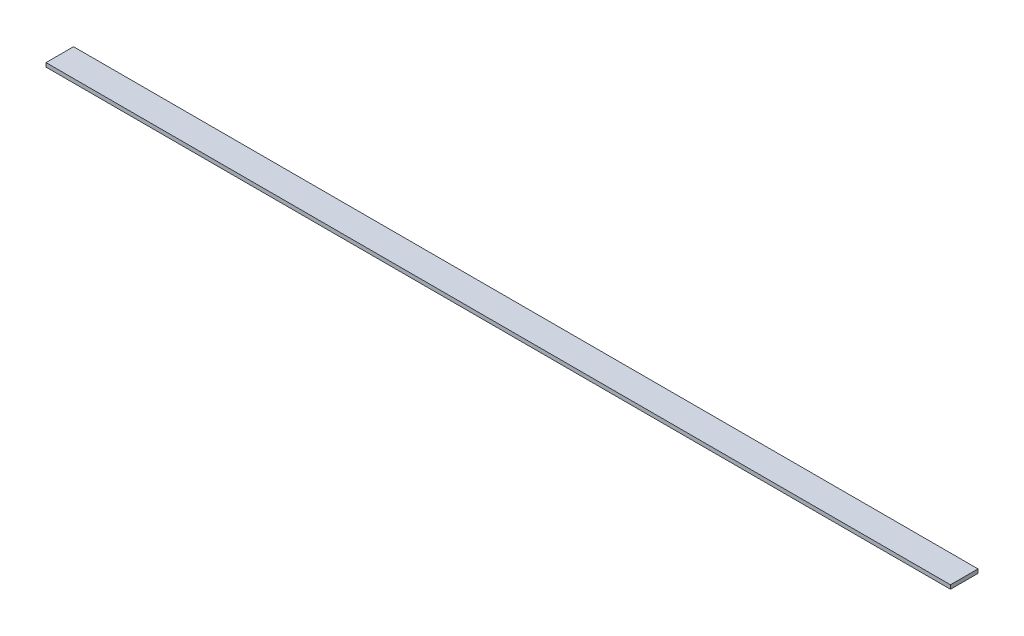
ISO-10303-21;
HEADER;
FILE_DESCRIPTION(('STEP AP214'),'2;1');
FILE_NAME('part.step','',(''),(''),'','','');
FILE_SCHEMA(('AUTOMOTIVE_DESIGN { 1 0 10303 214 1 1 1 1 }'));
ENDSEC;
DATA;
#1=APPLICATION_CONTEXT('core data for automotive mechanical design processes');
#2=APPLICATION_PROTOCOL_DEFINITION('international standard','automotive_design',2000,#1);
#3=PRODUCT_CONTEXT('',#1,'mechanical');
#4=PRODUCT('Part','Part','',(#3));
#5=PRODUCT_RELATED_PRODUCT_CATEGORY('part','',(#4));
#6=PRODUCT_DEFINITION_FORMATION('','',#4);
#7=PRODUCT_DEFINITION_CONTEXT('part definition',#1,'design');
#8=PRODUCT_DEFINITION('design','',#6,#7);
#9=PRODUCT_DEFINITION_SHAPE('','',#8);
#10=(LENGTH_UNIT() NAMED_UNIT(*) SI_UNIT(.MILLI.,.METRE.));
#11=(NAMED_UNIT(*) PLANE_ANGLE_UNIT() SI_UNIT($,.RADIAN.));
#12=(NAMED_UNIT(*) SI_UNIT($,.STERADIAN.) SOLID_ANGLE_UNIT());
#13=UNCERTAINTY_MEASURE_WITH_UNIT(LENGTH_MEASURE(1.E-05),#10,'distance_accuracy_value','');
#14=(GEOMETRIC_REPRESENTATION_CONTEXT(3) GLOBAL_UNCERTAINTY_ASSIGNED_CONTEXT((#13)) GLOBAL_UNIT_ASSIGNED_CONTEXT((#10,
#11,#12)) REPRESENTATION_CONTEXT('',''));
#15=CARTESIAN_POINT('',(0.,0.,0.));
#16=DIRECTION('',(0.,0.,1.));
#17=DIRECTION('',(1.,0.,0.));
#18=AXIS2_PLACEMENT_3D('',#15,#16,#17);
#19=CARTESIAN_POINT('',(-109.422255413766,12.7,-29.6424310962161));
#20=DIRECTION('',(1.,0.,0.));
#21=DIRECTION('',(0.,0.,-1.));
#22=AXIS2_PLACEMENT_3D('',#19,#20,#21);
#23=PLANE('',#22);
#24=DIRECTION('',(0.,0.,1.));
#25=VECTOR('',#24,1.);
#26=CARTESIAN_POINT('',(-109.422255413766,0.,-29.6424310962161));
#27=LINE('',#26,#25);
#28=CARTESIAN_POINT('',(-109.422255413766,0.,-29.6424310962161));
#29=VERTEX_POINT('',#28);
#30=CARTESIAN_POINT('',(-109.422255413766,0.,59.2575689037839));
#31=VERTEX_POINT('',#30);
#32=EDGE_CURVE('E96',#29,#31,#27,.T.);
#33=ORIENTED_EDGE('',*,*,#32,.T.);
#34=DIRECTION('',(0.,-1.,0.));
#35=VECTOR('',#34,1.);
#36=CARTESIAN_POINT('',(-109.422255413766,12.7,59.2575689037839));
#37=LINE('',#36,#35);
#38=CARTESIAN_POINT('',(-109.422255413766,12.7,59.2575689037839));
#39=VERTEX_POINT('',#38);
#40=EDGE_CURVE('E11',#39,#31,#37,.T.);
#41=ORIENTED_EDGE('',*,*,#40,.F.);
#42=DIRECTION('',(0.,0.,1.));
#43=VECTOR('',#42,1.);
#44=CARTESIAN_POINT('',(-109.422255413766,12.7,-29.6424310962161));
#45=LINE('',#44,#43);
#46=CARTESIAN_POINT('',(-109.422255413766,12.7,-29.6424310962161));
#47=VERTEX_POINT('',#46);
#48=EDGE_CURVE('E84',#47,#39,#45,.T.);
#49=ORIENTED_EDGE('',*,*,#48,.F.);
#50=DIRECTION('',(0.,-1.,0.));
#51=VECTOR('',#50,1.);
#52=CARTESIAN_POINT('',(-109.422255413766,12.7,-29.6424310962161));
#53=LINE('',#52,#51);
#54=EDGE_CURVE('E92',#47,#29,#53,.T.);
#55=ORIENTED_EDGE('',*,*,#54,.T.);
#56=EDGE_LOOP('',(#33,#41,#49,#55));
#57=FACE_BOUND('',#56,.T.);
#58=ADVANCED_FACE('F33',(#57),#23,.F.);
#59=CARTESIAN_POINT('',(-109.422255413766,12.7,59.2575689037839));
#60=DIRECTION('',(0.,0.,-1.));
#61=DIRECTION('',(-1.,0.,0.));
#62=AXIS2_PLACEMENT_3D('',#59,#60,#61);
#63=PLANE('',#62);
#64=DIRECTION('',(1.,0.,0.));
#65=VECTOR('',#64,1.);
#66=CARTESIAN_POINT('',(-109.422255413766,0.,59.2575689037839));
#67=LINE('',#66,#65);
#68=CARTESIAN_POINT('',(2811.57774458623,0.,59.2575689037839));
#69=VERTEX_POINT('',#68);
#70=EDGE_CURVE('E88',#31,#69,#67,.T.);
#71=ORIENTED_EDGE('',*,*,#70,.T.);
#72=DIRECTION('',(0.,-1.,0.));
#73=VECTOR('',#72,1.);
#74=CARTESIAN_POINT('',(2811.57774458623,12.7,59.2575689037839));
#75=LINE('',#74,#73);
#76=CARTESIAN_POINT('',(2811.57774458623,12.7,59.2575689037839));
#77=VERTEX_POINT('',#76);
#78=EDGE_CURVE('E41',#77,#69,#75,.T.);
#79=ORIENTED_EDGE('',*,*,#78,.F.);
#80=DIRECTION('',(1.,0.,0.));
#81=VECTOR('',#80,1.);
#82=CARTESIAN_POINT('',(-109.422255413766,12.7,59.2575689037839));
#83=LINE('',#82,#81);
#84=EDGE_CURVE('E79',#39,#77,#83,.T.);
#85=ORIENTED_EDGE('',*,*,#84,.F.);
#86=ORIENTED_EDGE('',*,*,#40,.T.);
#87=EDGE_LOOP('',(#71,#79,#85,#86));
#88=FACE_BOUND('',#87,.T.);
#89=ADVANCED_FACE('F87',(#88),#63,.F.);
#90=CARTESIAN_POINT('',(2811.57774458623,12.7,-29.6424310962161));
#91=DIRECTION('',(-1.,0.,0.));
#92=DIRECTION('',(0.,0.,1.));
#93=AXIS2_PLACEMENT_3D('',#90,#91,#92);
#94=PLANE('',#93);
#95=DIRECTION('',(0.,0.,-1.));
#96=VECTOR('',#95,1.);
#97=CARTESIAN_POINT('',(2811.57774458623,0.,-29.6424310962161));
#98=LINE('',#97,#96);
#99=CARTESIAN_POINT('',(2811.57774458623,0.,-29.6424310962161));
#100=VERTEX_POINT('',#99);
#101=EDGE_CURVE('E66',#69,#100,#98,.T.);
#102=ORIENTED_EDGE('',*,*,#101,.T.);
#103=DIRECTION('',(0.,-1.,0.));
#104=VECTOR('',#103,1.);
#105=CARTESIAN_POINT('',(2811.57774458623,12.7,-29.6424310962161));
#106=LINE('',#105,#104);
#107=CARTESIAN_POINT('',(2811.57774458623,12.7,-29.6424310962161));
#108=VERTEX_POINT('',#107);
#109=EDGE_CURVE('E89',#108,#100,#106,.T.);
#110=ORIENTED_EDGE('',*,*,#109,.F.);
#111=DIRECTION('',(0.,0.,-1.));
#112=VECTOR('',#111,1.);
#113=CARTESIAN_POINT('',(2811.57774458623,12.7,-29.6424310962161));
#114=LINE('',#113,#112);
#115=EDGE_CURVE('E82',#77,#108,#114,.T.);
#116=ORIENTED_EDGE('',*,*,#115,.F.);
#117=ORIENTED_EDGE('',*,*,#78,.T.);
#118=EDGE_LOOP('',(#102,#110,#116,#117));
#119=FACE_BOUND('',#118,.T.);
#120=ADVANCED_FACE('F90',(#119),#94,.F.);
#121=CARTESIAN_POINT('',(-109.422255413766,12.7,-29.6424310962161));
#122=DIRECTION('',(0.,0.,1.));
#123=DIRECTION('',(1.,0.,0.));
#124=AXIS2_PLACEMENT_3D('',#121,#122,#123);
#125=PLANE('',#124);
#126=DIRECTION('',(-1.,0.,0.));
#127=VECTOR('',#126,1.);
#128=CARTESIAN_POINT('',(-109.422255413766,0.,-29.6424310962161));
#129=LINE('',#128,#127);
#130=EDGE_CURVE('E72',#100,#29,#129,.T.);
#131=ORIENTED_EDGE('',*,*,#130,.T.);
#132=ORIENTED_EDGE('',*,*,#54,.F.);
#133=DIRECTION('',(-1.,0.,0.));
#134=VECTOR('',#133,1.);
#135=CARTESIAN_POINT('',(-109.422255413766,12.7,-29.6424310962161));
#136=LINE('',#135,#134);
#137=EDGE_CURVE('E49',#108,#47,#136,.T.);
#138=ORIENTED_EDGE('',*,*,#137,.F.);
#139=ORIENTED_EDGE('',*,*,#109,.T.);
#140=EDGE_LOOP('',(#131,#132,#138,#139));
#141=FACE_BOUND('',#140,.T.);
#142=ADVANCED_FACE('F103',(#141),#125,.F.);
#143=CARTESIAN_POINT('',(0.,12.7,0.));
#144=DIRECTION('',(0.,1.,0.));
#145=DIRECTION('',(0.,0.,1.));
#146=AXIS2_PLACEMENT_3D('',#143,#144,#145);
#147=PLANE('',#146);
#148=ORIENTED_EDGE('',*,*,#48,.T.);
#149=ORIENTED_EDGE('',*,*,#84,.T.);
#150=ORIENTED_EDGE('',*,*,#115,.T.);
#151=ORIENTED_EDGE('',*,*,#137,.T.);
#152=EDGE_LOOP('',(#148,#149,#150,#151));
#153=FACE_BOUND('',#152,.T.);
#154=ADVANCED_FACE('F80',(#153),#147,.T.);
#155=CARTESIAN_POINT('',(0.,0.,0.));
#156=DIRECTION('',(0.,1.,0.));
#157=DIRECTION('',(0.,0.,1.));
#158=AXIS2_PLACEMENT_3D('',#155,#156,#157);
#159=PLANE('',#158);
#160=ORIENTED_EDGE('',*,*,#32,.F.);
#161=ORIENTED_EDGE('',*,*,#130,.F.);
#162=ORIENTED_EDGE('',*,*,#101,.F.);
#163=ORIENTED_EDGE('',*,*,#70,.F.);
#164=EDGE_LOOP('',(#160,#161,#162,#163));
#165=FACE_BOUND('',#164,.T.);
#166=ADVANCED_FACE('F106',(#165),#159,.F.);
#167=CLOSED_SHELL('',(#58,#89,#120,#142,#154,#166));
#168=MANIFOLD_SOLID_BREP('B2',#167);
#169=ADVANCED_BREP_SHAPE_REPRESENTATION('',(#18,#168),#14);
#170=SHAPE_DEFINITION_REPRESENTATION(#9,#169);
ENDSEC;
END-ISO-10303-21;
